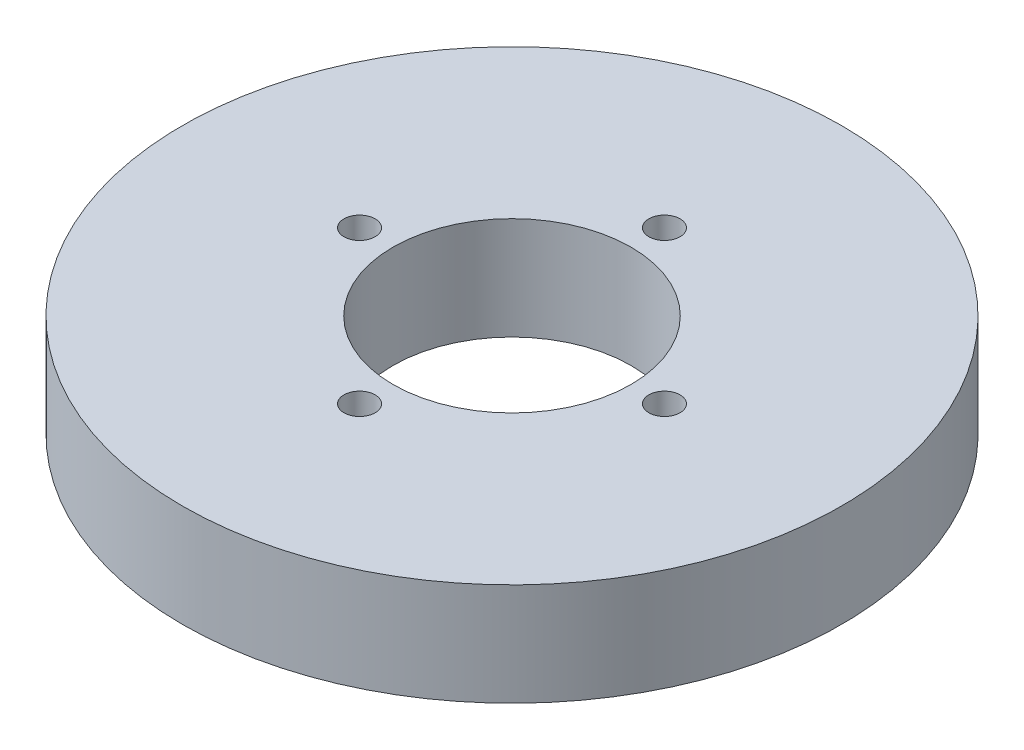
ISO-10303-21;
HEADER;
FILE_DESCRIPTION(('STEP AP214'),'2;1');
FILE_NAME('part.step','',(''),(''),'','','');
FILE_SCHEMA(('AUTOMOTIVE_DESIGN { 1 0 10303 214 1 1 1 1 }'));
ENDSEC;
DATA;
#1=APPLICATION_CONTEXT('core data for automotive mechanical design processes');
#2=APPLICATION_PROTOCOL_DEFINITION('international standard','automotive_design',2000,#1);
#3=PRODUCT_CONTEXT('',#1,'mechanical');
#4=PRODUCT('Part','Part','',(#3));
#5=PRODUCT_RELATED_PRODUCT_CATEGORY('part','',(#4));
#6=PRODUCT_DEFINITION_FORMATION('','',#4);
#7=PRODUCT_DEFINITION_CONTEXT('part definition',#1,'design');
#8=PRODUCT_DEFINITION('design','',#6,#7);
#9=PRODUCT_DEFINITION_SHAPE('','',#8);
#10=(LENGTH_UNIT() NAMED_UNIT(*) SI_UNIT(.MILLI.,.METRE.));
#11=(NAMED_UNIT(*) PLANE_ANGLE_UNIT() SI_UNIT($,.RADIAN.));
#12=(NAMED_UNIT(*) SI_UNIT($,.STERADIAN.) SOLID_ANGLE_UNIT());
#13=UNCERTAINTY_MEASURE_WITH_UNIT(LENGTH_MEASURE(1.E-05),#10,'distance_accuracy_value','');
#14=(GEOMETRIC_REPRESENTATION_CONTEXT(3) GLOBAL_UNCERTAINTY_ASSIGNED_CONTEXT((#13)) GLOBAL_UNIT_ASSIGNED_CONTEXT((#10,
#11,#12)) REPRESENTATION_CONTEXT('',''));
#15=CARTESIAN_POINT('',(0.,0.,0.));
#16=DIRECTION('',(0.,0.,1.));
#17=DIRECTION('',(1.,0.,0.));
#18=AXIS2_PLACEMENT_3D('',#15,#16,#17);
#19=CARTESIAN_POINT('',(0.,28.,0.));
#20=DIRECTION('',(0.,-1.,0.));
#21=DIRECTION('',(0.,0.,-1.));
#22=AXIS2_PLACEMENT_3D('',#19,#20,#21);
#23=CYLINDRICAL_SURFACE('',#22,90.);
#24=CARTESIAN_POINT('',(0.,28.,0.));
#25=DIRECTION('',(0.,1.,0.));
#26=DIRECTION('',(0.,0.,1.));
#27=AXIS2_PLACEMENT_3D('',#24,#25,#26);
#28=CIRCLE('',#27,90.);
#29=CARTESIAN_POINT('',(0.,28.,90.));
#30=VERTEX_POINT('',#29);
#31=EDGE_CURVE('E10',#30,#30,#28,.T.);
#32=ORIENTED_EDGE('',*,*,#31,.F.);
#33=EDGE_LOOP('',(#32));
#34=FACE_BOUND('',#33,.T.);
#35=CARTESIAN_POINT('',(0.,0.,0.));
#36=DIRECTION('',(0.,1.,0.));
#37=DIRECTION('',(0.,0.,1.));
#38=AXIS2_PLACEMENT_3D('',#35,#36,#37);
#39=CIRCLE('',#38,90.);
#40=CARTESIAN_POINT('',(0.,0.,90.));
#41=VERTEX_POINT('',#40);
#42=EDGE_CURVE('E37',#41,#41,#39,.T.);
#43=ORIENTED_EDGE('',*,*,#42,.T.);
#44=EDGE_LOOP('',(#43));
#45=FACE_BOUND('',#44,.T.);
#46=ADVANCED_FACE('F40',(#34,#45),#23,.T.);
#47=CARTESIAN_POINT('',(0.,28.,0.));
#48=DIRECTION('',(0.,1.,0.));
#49=DIRECTION('',(0.,0.,1.));
#50=AXIS2_PLACEMENT_3D('',#47,#48,#49);
#51=PLANE('',#50);
#52=CARTESIAN_POINT('',(1.4535927455505E-13,28.,41.6325508997889));
#53=DIRECTION('',(0.,1.,0.));
#54=DIRECTION('',(1.,0.,0.));
#55=AXIS2_PLACEMENT_3D('',#52,#53,#54);
#56=CIRCLE('',#55,4.25586529931839);
#57=CARTESIAN_POINT('',(4.25586529931853,28.,41.6325508997889));
#58=VERTEX_POINT('',#57);
#59=EDGE_CURVE('E71',#58,#58,#56,.T.);
#60=ORIENTED_EDGE('',*,*,#59,.F.);
#61=EDGE_LOOP('',(#60));
#62=FACE_BOUND('',#61,.T.);
#63=CARTESIAN_POINT('',(41.6325508997889,28.,0.));
#64=DIRECTION('',(0.,1.,0.));
#65=DIRECTION('',(0.,0.,-1.));
#66=AXIS2_PLACEMENT_3D('',#63,#64,#65);
#67=CIRCLE('',#66,4.25586529931839);
#68=CARTESIAN_POINT('',(41.6325508997889,28.,-4.25586529931839));
#69=VERTEX_POINT('',#68);
#70=EDGE_CURVE('E70',#69,#69,#67,.T.);
#71=ORIENTED_EDGE('',*,*,#70,.F.);
#72=EDGE_LOOP('',(#71));
#73=FACE_BOUND('',#72,.T.);
#74=CARTESIAN_POINT('',(-4.36077823665149E-13,28.,-41.6325508997889));
#75=DIRECTION('',(0.,1.,0.));
#76=DIRECTION('',(-1.,0.,0.));
#77=AXIS2_PLACEMENT_3D('',#74,#75,#76);
#78=CIRCLE('',#77,4.25586529931839);
#79=CARTESIAN_POINT('',(-4.25586529931882,28.,-41.6325508997889));
#80=VERTEX_POINT('',#79);
#81=EDGE_CURVE('E61',#80,#80,#78,.T.);
#82=ORIENTED_EDGE('',*,*,#81,.F.);
#83=EDGE_LOOP('',(#82));
#84=FACE_BOUND('',#83,.T.);
#85=CARTESIAN_POINT('',(-41.6325508997889,28.,0.));
#86=DIRECTION('',(0.,1.,0.));
#87=DIRECTION('',(0.,0.,1.));
#88=AXIS2_PLACEMENT_3D('',#85,#86,#87);
#89=CIRCLE('',#88,4.25586529931839);
#90=CARTESIAN_POINT('',(-41.6325508997889,28.,4.25586529931839));
#91=VERTEX_POINT('',#90);
#92=EDGE_CURVE('E54',#91,#91,#89,.T.);
#93=ORIENTED_EDGE('',*,*,#92,.F.);
#94=EDGE_LOOP('',(#93));
#95=FACE_BOUND('',#94,.T.);
#96=CARTESIAN_POINT('',(0.,28.,0.));
#97=DIRECTION('',(0.,1.,0.));
#98=DIRECTION('',(0.,0.,1.));
#99=AXIS2_PLACEMENT_3D('',#96,#97,#98);
#100=CIRCLE('',#99,32.5);
#101=CARTESIAN_POINT('',(0.,28.,32.5));
#102=VERTEX_POINT('',#101);
#103=EDGE_CURVE('E50',#102,#102,#100,.T.);
#104=ORIENTED_EDGE('',*,*,#103,.F.);
#105=EDGE_LOOP('',(#104));
#106=FACE_BOUND('',#105,.T.);
#107=ORIENTED_EDGE('',*,*,#31,.T.);
#108=EDGE_LOOP('',(#107));
#109=FACE_BOUND('',#108,.T.);
#110=ADVANCED_FACE('F86',(#62,#73,#84,#95,#106,#109),#51,.T.);
#111=CARTESIAN_POINT('',(0.,0.,0.));
#112=DIRECTION('',(0.,1.,0.));
#113=DIRECTION('',(0.,0.,1.));
#114=AXIS2_PLACEMENT_3D('',#111,#112,#113);
#115=PLANE('',#114);
#116=CARTESIAN_POINT('',(0.,0.,0.));
#117=DIRECTION('',(0.,1.,0.));
#118=DIRECTION('',(0.,0.,1.));
#119=AXIS2_PLACEMENT_3D('',#116,#117,#118);
#120=CIRCLE('',#119,32.5);
#121=CARTESIAN_POINT('',(0.,0.,32.5));
#122=VERTEX_POINT('',#121);
#123=EDGE_CURVE('E47',#122,#122,#120,.T.);
#124=ORIENTED_EDGE('',*,*,#123,.T.);
#125=EDGE_LOOP('',(#124));
#126=FACE_BOUND('',#125,.T.);
#127=ORIENTED_EDGE('',*,*,#42,.F.);
#128=EDGE_LOOP('',(#127));
#129=FACE_BOUND('',#128,.T.);
#130=ADVANCED_FACE('F93',(#126,#129),#115,.F.);
#131=CARTESIAN_POINT('',(0.,28.,0.));
#132=DIRECTION('',(0.,-1.,0.));
#133=DIRECTION('',(0.,0.,-1.));
#134=AXIS2_PLACEMENT_3D('',#131,#132,#133);
#135=CYLINDRICAL_SURFACE('',#134,32.5);
#136=ORIENTED_EDGE('',*,*,#103,.T.);
#137=EDGE_LOOP('',(#136));
#138=FACE_BOUND('',#137,.T.);
#139=ORIENTED_EDGE('',*,*,#123,.F.);
#140=EDGE_LOOP('',(#139));
#141=FACE_BOUND('',#140,.T.);
#142=ADVANCED_FACE('F101',(#138,#141),#135,.F.);
#143=CARTESIAN_POINT('',(-41.6325508997889,9.06984530397921,0.));
#144=DIRECTION('',(0.,1.,0.));
#145=DIRECTION('',(0.,0.,1.));
#146=AXIS2_PLACEMENT_3D('',#143,#144,#145);
#147=CYLINDRICAL_SURFACE('',#146,4.25586529931839);
#148=CARTESIAN_POINT('',(-41.6325508997889,9.06984530397921,0.));
#149=DIRECTION('',(0.,1.,0.));
#150=DIRECTION('',(0.,0.,1.));
#151=AXIS2_PLACEMENT_3D('',#148,#149,#150);
#152=CIRCLE('',#151,4.25586529931839);
#153=CARTESIAN_POINT('',(-41.6325508997889,9.06984530397921,4.25586529931839));
#154=VERTEX_POINT('',#153);
#155=EDGE_CURVE('E55',#154,#154,#152,.T.);
#156=ORIENTED_EDGE('',*,*,#155,.F.);
#157=EDGE_LOOP('',(#156));
#158=FACE_BOUND('',#157,.T.);
#159=ORIENTED_EDGE('',*,*,#92,.T.);
#160=EDGE_LOOP('',(#159));
#161=FACE_BOUND('',#160,.T.);
#162=ADVANCED_FACE('F102',(#158,#161),#147,.F.);
#163=CARTESIAN_POINT('',(-41.6325508997889,9.06984530397921,0.));
#164=DIRECTION('',(0.,1.,0.));
#165=DIRECTION('',(0.,0.,1.));
#166=AXIS2_PLACEMENT_3D('',#163,#164,#165);
#167=PLANE('',#166);
#168=ORIENTED_EDGE('',*,*,#155,.T.);
#169=EDGE_LOOP('',(#168));
#170=FACE_BOUND('',#169,.T.);
#171=ADVANCED_FACE('F133',(#170),#167,.T.);
#172=CARTESIAN_POINT('',(-4.36077823665149E-13,9.06984530397921,-41.6325508997889));
#173=DIRECTION('',(0.,1.,0.));
#174=DIRECTION('',(0.,0.,1.));
#175=AXIS2_PLACEMENT_3D('',#172,#173,#174);
#176=CYLINDRICAL_SURFACE('',#175,4.25586529931839);
#177=CARTESIAN_POINT('',(-4.36077823665149E-13,9.06984530397921,-41.6325508997889));
#178=DIRECTION('',(0.,1.,0.));
#179=DIRECTION('',(-1.,0.,0.));
#180=AXIS2_PLACEMENT_3D('',#177,#178,#179);
#181=CIRCLE('',#180,4.25586529931839);
#182=CARTESIAN_POINT('',(-4.25586529931882,9.06984530397921,-41.6325508997889));
#183=VERTEX_POINT('',#182);
#184=EDGE_CURVE('E63',#183,#183,#181,.T.);
#185=ORIENTED_EDGE('',*,*,#184,.F.);
#186=EDGE_LOOP('',(#185));
#187=FACE_BOUND('',#186,.T.);
#188=ORIENTED_EDGE('',*,*,#81,.T.);
#189=EDGE_LOOP('',(#188));
#190=FACE_BOUND('',#189,.T.);
#191=ADVANCED_FACE('F142',(#187,#190),#176,.F.);
#192=CARTESIAN_POINT('',(-4.36077823665149E-13,9.06984530397921,-41.6325508997889));
#193=DIRECTION('',(0.,1.,0.));
#194=DIRECTION('',(-1.,0.,0.));
#195=AXIS2_PLACEMENT_3D('',#192,#193,#194);
#196=PLANE('',#195);
#197=ORIENTED_EDGE('',*,*,#184,.T.);
#198=EDGE_LOOP('',(#197));
#199=FACE_BOUND('',#198,.T.);
#200=ADVANCED_FACE('F156',(#199),#196,.T.);
#201=CARTESIAN_POINT('',(41.6325508997889,9.06984530397921,0.));
#202=DIRECTION('',(0.,1.,0.));
#203=DIRECTION('',(0.,0.,1.));
#204=AXIS2_PLACEMENT_3D('',#201,#202,#203);
#205=CYLINDRICAL_SURFACE('',#204,4.25586529931839);
#206=CARTESIAN_POINT('',(41.6325508997889,9.06984530397921,0.));
#207=DIRECTION('',(0.,1.,0.));
#208=DIRECTION('',(0.,0.,-1.));
#209=AXIS2_PLACEMENT_3D('',#206,#207,#208);
#210=CIRCLE('',#209,4.25586529931839);
#211=CARTESIAN_POINT('',(41.6325508997889,9.06984530397921,-4.25586529931839));
#212=VERTEX_POINT('',#211);
#213=EDGE_CURVE('E69',#212,#212,#210,.T.);
#214=ORIENTED_EDGE('',*,*,#213,.F.);
#215=EDGE_LOOP('',(#214));
#216=FACE_BOUND('',#215,.T.);
#217=ORIENTED_EDGE('',*,*,#70,.T.);
#218=EDGE_LOOP('',(#217));
#219=FACE_BOUND('',#218,.T.);
#220=ADVANCED_FACE('F164',(#216,#219),#205,.F.);
#221=CARTESIAN_POINT('',(41.6325508997889,9.06984530397921,0.));
#222=DIRECTION('',(0.,1.,0.));
#223=DIRECTION('',(0.,0.,-1.));
#224=AXIS2_PLACEMENT_3D('',#221,#222,#223);
#225=PLANE('',#224);
#226=ORIENTED_EDGE('',*,*,#213,.T.);
#227=EDGE_LOOP('',(#226));
#228=FACE_BOUND('',#227,.T.);
#229=ADVANCED_FACE('F83',(#228),#225,.T.);
#230=CARTESIAN_POINT('',(1.4535927455505E-13,9.06984530397921,41.6325508997889));
#231=DIRECTION('',(0.,1.,0.));
#232=DIRECTION('',(0.,0.,1.));
#233=AXIS2_PLACEMENT_3D('',#230,#231,#232);
#234=CYLINDRICAL_SURFACE('',#233,4.25586529931839);
#235=CARTESIAN_POINT('',(1.4535927455505E-13,9.06984530397921,41.6325508997889));
#236=DIRECTION('',(0.,1.,0.));
#237=DIRECTION('',(1.,0.,0.));
#238=AXIS2_PLACEMENT_3D('',#235,#236,#237);
#239=CIRCLE('',#238,4.25586529931839);
#240=CARTESIAN_POINT('',(4.25586529931853,9.06984530397921,41.6325508997889));
#241=VERTEX_POINT('',#240);
#242=EDGE_CURVE('E59',#241,#241,#239,.T.);
#243=ORIENTED_EDGE('',*,*,#242,.F.);
#244=EDGE_LOOP('',(#243));
#245=FACE_BOUND('',#244,.T.);
#246=ORIENTED_EDGE('',*,*,#59,.T.);
#247=EDGE_LOOP('',(#246));
#248=FACE_BOUND('',#247,.T.);
#249=ADVANCED_FACE('F81',(#245,#248),#234,.F.);
#250=CARTESIAN_POINT('',(1.4535927455505E-13,9.06984530397921,41.6325508997889));
#251=DIRECTION('',(0.,1.,0.));
#252=DIRECTION('',(1.,0.,0.));
#253=AXIS2_PLACEMENT_3D('',#250,#251,#252);
#254=PLANE('',#253);
#255=ORIENTED_EDGE('',*,*,#242,.T.);
#256=EDGE_LOOP('',(#255));
#257=FACE_BOUND('',#256,.T.);
#258=ADVANCED_FACE('F78',(#257),#254,.T.);
#259=CLOSED_SHELL('',(#46,#110,#130,#142,#162,#171,#191,#200,#220,#229,#249,#258));
#260=MANIFOLD_SOLID_BREP('B2',#259);
#261=ADVANCED_BREP_SHAPE_REPRESENTATION('',(#18,#260),#14);
#262=SHAPE_DEFINITION_REPRESENTATION(#9,#261);
ENDSEC;
END-ISO-10303-21;
